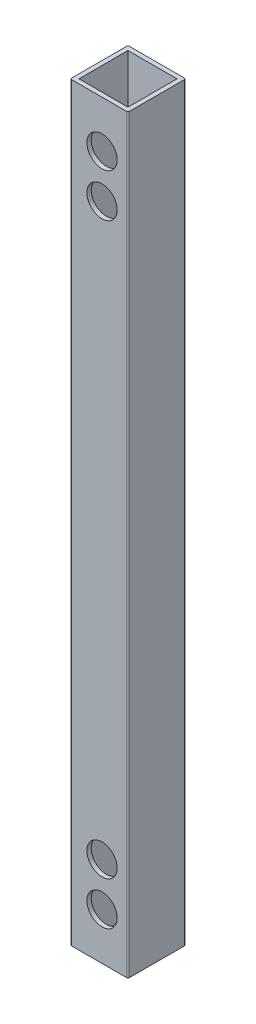
ISO-10303-21;
HEADER;
FILE_DESCRIPTION(('STEP AP214'),'2;1');
FILE_NAME('part.step','',(''),(''),'','','');
FILE_SCHEMA(('AUTOMOTIVE_DESIGN { 1 0 10303 214 1 1 1 1 }'));
ENDSEC;
DATA;
#1=APPLICATION_CONTEXT('core data for automotive mechanical design processes');
#2=APPLICATION_PROTOCOL_DEFINITION('international standard','automotive_design',2000,#1);
#3=PRODUCT_CONTEXT('',#1,'mechanical');
#4=PRODUCT('Part','Part','',(#3));
#5=PRODUCT_RELATED_PRODUCT_CATEGORY('part','',(#4));
#6=PRODUCT_DEFINITION_FORMATION('','',#4);
#7=PRODUCT_DEFINITION_CONTEXT('part definition',#1,'design');
#8=PRODUCT_DEFINITION('design','',#6,#7);
#9=PRODUCT_DEFINITION_SHAPE('','',#8);
#10=(LENGTH_UNIT() NAMED_UNIT(*) SI_UNIT(.MILLI.,.METRE.));
#11=(NAMED_UNIT(*) PLANE_ANGLE_UNIT() SI_UNIT($,.RADIAN.));
#12=(NAMED_UNIT(*) SI_UNIT($,.STERADIAN.) SOLID_ANGLE_UNIT());
#13=UNCERTAINTY_MEASURE_WITH_UNIT(LENGTH_MEASURE(1.E-05),#10,'distance_accuracy_value','');
#14=(GEOMETRIC_REPRESENTATION_CONTEXT(3) GLOBAL_UNCERTAINTY_ASSIGNED_CONTEXT((#13)) GLOBAL_UNIT_ASSIGNED_CONTEXT((#10,
#11,#12)) REPRESENTATION_CONTEXT('',''));
#15=CARTESIAN_POINT('',(0.,0.,0.));
#16=DIRECTION('',(0.,0.,1.));
#17=DIRECTION('',(1.,0.,0.));
#18=AXIS2_PLACEMENT_3D('',#15,#16,#17);
#19=CARTESIAN_POINT('',(19.5,260.,-0.5));
#20=DIRECTION('',(0.,1.,0.));
#21=DIRECTION('',(0.,0.,1.));
#22=AXIS2_PLACEMENT_3D('',#19,#20,#21);
#23=PLANE('',#22);
#24=CARTESIAN_POINT('',(19.5,260.,-0.5));
#25=DIRECTION('',(0.,1.,0.));
#26=DIRECTION('',(0.,0.,1.));
#27=AXIS2_PLACEMENT_3D('',#24,#25,#26);
#28=CIRCLE('',#27,0.5);
#29=CARTESIAN_POINT('',(19.5,260.,0.));
#30=VERTEX_POINT('',#29);
#31=CARTESIAN_POINT('',(20.,260.,-0.5));
#32=VERTEX_POINT('',#31);
#33=EDGE_CURVE('E162',#30,#32,#28,.T.);
#34=ORIENTED_EDGE('',*,*,#33,.T.);
#35=DIRECTION('',(0.,0.,-1.));
#36=VECTOR('',#35,1.);
#37=CARTESIAN_POINT('',(20.,260.,-0.5));
#38=LINE('',#37,#36);
#39=CARTESIAN_POINT('',(20.,260.,-19.5));
#40=VERTEX_POINT('',#39);
#41=EDGE_CURVE('E165',#32,#40,#38,.T.);
#42=ORIENTED_EDGE('',*,*,#41,.T.);
#43=CARTESIAN_POINT('',(19.5,260.,-19.5));
#44=DIRECTION('',(0.,1.,0.));
#45=DIRECTION('',(0.,0.,-1.));
#46=AXIS2_PLACEMENT_3D('',#43,#44,#45);
#47=CIRCLE('',#46,0.5);
#48=CARTESIAN_POINT('',(19.5,260.,-20.));
#49=VERTEX_POINT('',#48);
#50=EDGE_CURVE('E168',#40,#49,#47,.T.);
#51=ORIENTED_EDGE('',*,*,#50,.T.);
#52=DIRECTION('',(-1.,0.,0.));
#53=VECTOR('',#52,1.);
#54=CARTESIAN_POINT('',(0.5,260.,-20.));
#55=LINE('',#54,#53);
#56=CARTESIAN_POINT('',(0.5,260.,-20.));
#57=VERTEX_POINT('',#56);
#58=EDGE_CURVE('E170',#49,#57,#55,.T.);
#59=ORIENTED_EDGE('',*,*,#58,.T.);
#60=CARTESIAN_POINT('',(0.5,260.,-19.5));
#61=DIRECTION('',(0.,1.,0.));
#62=DIRECTION('',(0.,0.,-1.));
#63=AXIS2_PLACEMENT_3D('',#60,#61,#62);
#64=CIRCLE('',#63,0.5);
#65=CARTESIAN_POINT('',(0.,260.,-19.5));
#66=VERTEX_POINT('',#65);
#67=EDGE_CURVE('E172',#57,#66,#64,.T.);
#68=ORIENTED_EDGE('',*,*,#67,.T.);
#69=DIRECTION('',(0.,0.,1.));
#70=VECTOR('',#69,1.);
#71=CARTESIAN_POINT('',(0.,260.,-0.500000000000004));
#72=LINE('',#71,#70);
#73=CARTESIAN_POINT('',(0.,260.,-0.500000000000003));
#74=VERTEX_POINT('',#73);
#75=EDGE_CURVE('E174',#66,#74,#72,.T.);
#76=ORIENTED_EDGE('',*,*,#75,.T.);
#77=CARTESIAN_POINT('',(0.5,260.,-0.5));
#78=DIRECTION('',(0.,1.,0.));
#79=DIRECTION('',(0.,0.,-1.));
#80=AXIS2_PLACEMENT_3D('',#77,#78,#79);
#81=CIRCLE('',#80,0.5);
#82=CARTESIAN_POINT('',(0.500000000000004,260.,0.));
#83=VERTEX_POINT('',#82);
#84=EDGE_CURVE('E176',#74,#83,#81,.T.);
#85=ORIENTED_EDGE('',*,*,#84,.T.);
#86=DIRECTION('',(1.,0.,0.));
#87=VECTOR('',#86,1.);
#88=CARTESIAN_POINT('',(0.500000000000004,260.,0.));
#89=LINE('',#88,#87);
#90=EDGE_CURVE('E178',#83,#30,#89,.T.);
#91=ORIENTED_EDGE('',*,*,#90,.T.);
#92=EDGE_LOOP('',(#34,#42,#51,#59,#68,#76,#85,#91));
#93=FACE_BOUND('',#92,.T.);
#94=DIRECTION('',(1.,0.,0.));
#95=VECTOR('',#94,1.);
#96=CARTESIAN_POINT('',(1.5,260.,-1.5));
#97=LINE('',#96,#95);
#98=CARTESIAN_POINT('',(1.5,260.,-1.5));
#99=VERTEX_POINT('',#98);
#100=CARTESIAN_POINT('',(18.5,260.,-1.5));
#101=VERTEX_POINT('',#100);
#102=EDGE_CURVE('E132',#99,#101,#97,.T.);
#103=ORIENTED_EDGE('',*,*,#102,.F.);
#104=DIRECTION('',(0.,0.,1.));
#105=VECTOR('',#104,1.);
#106=CARTESIAN_POINT('',(1.5,260.,-1.5));
#107=LINE('',#106,#105);
#108=CARTESIAN_POINT('',(1.5,260.,-18.5));
#109=VERTEX_POINT('',#108);
#110=EDGE_CURVE('E124',#109,#99,#107,.T.);
#111=ORIENTED_EDGE('',*,*,#110,.F.);
#112=DIRECTION('',(-1.,0.,0.));
#113=VECTOR('',#112,1.);
#114=CARTESIAN_POINT('',(1.5,260.,-18.5));
#115=LINE('',#114,#113);
#116=CARTESIAN_POINT('',(18.5,260.,-18.5));
#117=VERTEX_POINT('',#116);
#118=EDGE_CURVE('E146',#117,#109,#115,.T.);
#119=ORIENTED_EDGE('',*,*,#118,.F.);
#120=DIRECTION('',(0.,0.,-1.));
#121=VECTOR('',#120,1.);
#122=CARTESIAN_POINT('',(18.5,260.,-1.5));
#123=LINE('',#122,#121);
#124=EDGE_CURVE('E144',#101,#117,#123,.T.);
#125=ORIENTED_EDGE('',*,*,#124,.F.);
#126=EDGE_LOOP('',(#103,#111,#119,#125));
#127=FACE_BOUND('',#126,.T.);
#128=ADVANCED_FACE('F33',(#93,#127),#23,.T.);
#129=CARTESIAN_POINT('',(19.5,0.,-0.5));
#130=DIRECTION('',(0.,1.,0.));
#131=DIRECTION('',(0.,0.,1.));
#132=AXIS2_PLACEMENT_3D('',#129,#130,#131);
#133=PLANE('',#132);
#134=CARTESIAN_POINT('',(19.5,0.,-0.5));
#135=DIRECTION('',(0.,1.,0.));
#136=DIRECTION('',(0.,0.,1.));
#137=AXIS2_PLACEMENT_3D('',#134,#135,#136);
#138=CIRCLE('',#137,0.5);
#139=CARTESIAN_POINT('',(19.5,0.,0.));
#140=VERTEX_POINT('',#139);
#141=CARTESIAN_POINT('',(20.,0.,-0.5));
#142=VERTEX_POINT('',#141);
#143=EDGE_CURVE('E140',#140,#142,#138,.T.);
#144=ORIENTED_EDGE('',*,*,#143,.F.);
#145=DIRECTION('',(1.,0.,0.));
#146=VECTOR('',#145,1.);
#147=CARTESIAN_POINT('',(0.500000000000004,0.,0.));
#148=LINE('',#147,#146);
#149=CARTESIAN_POINT('',(0.500000000000004,0.,0.));
#150=VERTEX_POINT('',#149);
#151=EDGE_CURVE('E166',#150,#140,#148,.T.);
#152=ORIENTED_EDGE('',*,*,#151,.F.);
#153=CARTESIAN_POINT('',(0.5,0.,-0.5));
#154=DIRECTION('',(0.,1.,0.));
#155=DIRECTION('',(0.,0.,-1.));
#156=AXIS2_PLACEMENT_3D('',#153,#154,#155);
#157=CIRCLE('',#156,0.5);
#158=CARTESIAN_POINT('',(0.,0.,-0.500000000000003));
#159=VERTEX_POINT('',#158);
#160=EDGE_CURVE('E193',#159,#150,#157,.T.);
#161=ORIENTED_EDGE('',*,*,#160,.F.);
#162=DIRECTION('',(0.,0.,1.));
#163=VECTOR('',#162,1.);
#164=CARTESIAN_POINT('',(0.,0.,-0.500000000000004));
#165=LINE('',#164,#163);
#166=CARTESIAN_POINT('',(0.,0.,-19.5));
#167=VERTEX_POINT('',#166);
#168=EDGE_CURVE('E191',#167,#159,#165,.T.);
#169=ORIENTED_EDGE('',*,*,#168,.F.);
#170=CARTESIAN_POINT('',(0.5,0.,-19.5));
#171=DIRECTION('',(0.,1.,0.));
#172=DIRECTION('',(0.,0.,-1.));
#173=AXIS2_PLACEMENT_3D('',#170,#171,#172);
#174=CIRCLE('',#173,0.5);
#175=CARTESIAN_POINT('',(0.5,0.,-20.));
#176=VERTEX_POINT('',#175);
#177=EDGE_CURVE('E189',#176,#167,#174,.T.);
#178=ORIENTED_EDGE('',*,*,#177,.F.);
#179=DIRECTION('',(-1.,0.,0.));
#180=VECTOR('',#179,1.);
#181=CARTESIAN_POINT('',(0.5,0.,-20.));
#182=LINE('',#181,#180);
#183=CARTESIAN_POINT('',(19.5,0.,-20.));
#184=VERTEX_POINT('',#183);
#185=EDGE_CURVE('E187',#184,#176,#182,.T.);
#186=ORIENTED_EDGE('',*,*,#185,.F.);
#187=CARTESIAN_POINT('',(19.5,0.,-19.5));
#188=DIRECTION('',(0.,1.,0.));
#189=DIRECTION('',(0.,0.,-1.));
#190=AXIS2_PLACEMENT_3D('',#187,#188,#189);
#191=CIRCLE('',#190,0.5);
#192=CARTESIAN_POINT('',(20.,0.,-19.5));
#193=VERTEX_POINT('',#192);
#194=EDGE_CURVE('E185',#193,#184,#191,.T.);
#195=ORIENTED_EDGE('',*,*,#194,.F.);
#196=DIRECTION('',(0.,0.,-1.));
#197=VECTOR('',#196,1.);
#198=CARTESIAN_POINT('',(20.,0.,-0.5));
#199=LINE('',#198,#197);
#200=EDGE_CURVE('E183',#142,#193,#199,.T.);
#201=ORIENTED_EDGE('',*,*,#200,.F.);
#202=EDGE_LOOP('',(#144,#152,#161,#169,#178,#186,#195,#201));
#203=FACE_BOUND('',#202,.T.);
#204=DIRECTION('',(0.,0.,1.));
#205=VECTOR('',#204,1.);
#206=CARTESIAN_POINT('',(1.5,0.,-1.5));
#207=LINE('',#206,#205);
#208=CARTESIAN_POINT('',(1.5,0.,-18.5));
#209=VERTEX_POINT('',#208);
#210=CARTESIAN_POINT('',(1.5,0.,-1.5));
#211=VERTEX_POINT('',#210);
#212=EDGE_CURVE('E58',#209,#211,#207,.T.);
#213=ORIENTED_EDGE('',*,*,#212,.T.);
#214=DIRECTION('',(1.,0.,0.));
#215=VECTOR('',#214,1.);
#216=CARTESIAN_POINT('',(1.5,0.,-1.5));
#217=LINE('',#216,#215);
#218=CARTESIAN_POINT('',(18.5,0.,-1.5));
#219=VERTEX_POINT('',#218);
#220=EDGE_CURVE('E139',#211,#219,#217,.T.);
#221=ORIENTED_EDGE('',*,*,#220,.T.);
#222=DIRECTION('',(0.,0.,-1.));
#223=VECTOR('',#222,1.);
#224=CARTESIAN_POINT('',(18.5,0.,-1.5));
#225=LINE('',#224,#223);
#226=CARTESIAN_POINT('',(18.5,0.,-18.5));
#227=VERTEX_POINT('',#226);
#228=EDGE_CURVE('E154',#219,#227,#225,.T.);
#229=ORIENTED_EDGE('',*,*,#228,.T.);
#230=DIRECTION('',(-1.,0.,0.));
#231=VECTOR('',#230,1.);
#232=CARTESIAN_POINT('',(1.5,0.,-18.5));
#233=LINE('',#232,#231);
#234=EDGE_CURVE('E133',#227,#209,#233,.T.);
#235=ORIENTED_EDGE('',*,*,#234,.T.);
#236=EDGE_LOOP('',(#213,#221,#229,#235));
#237=FACE_BOUND('',#236,.T.);
#238=ADVANCED_FACE('F288',(#203,#237),#133,.F.);
#239=CARTESIAN_POINT('',(19.5,260.,-0.5));
#240=DIRECTION('',(0.,-1.,0.));
#241=DIRECTION('',(0.,0.,-1.));
#242=AXIS2_PLACEMENT_3D('',#239,#240,#241);
#243=CYLINDRICAL_SURFACE('',#242,0.5);
#244=ORIENTED_EDGE('',*,*,#143,.T.);
#245=DIRECTION('',(0.,-1.,0.));
#246=VECTOR('',#245,1.);
#247=CARTESIAN_POINT('',(20.,260.,-0.5));
#248=LINE('',#247,#246);
#249=EDGE_CURVE('E11',#32,#142,#248,.T.);
#250=ORIENTED_EDGE('',*,*,#249,.F.);
#251=ORIENTED_EDGE('',*,*,#33,.F.);
#252=DIRECTION('',(0.,-1.,0.));
#253=VECTOR('',#252,1.);
#254=CARTESIAN_POINT('',(19.5,260.,0.));
#255=LINE('',#254,#253);
#256=EDGE_CURVE('E180',#30,#140,#255,.T.);
#257=ORIENTED_EDGE('',*,*,#256,.T.);
#258=EDGE_LOOP('',(#244,#250,#251,#257));
#259=FACE_BOUND('',#258,.T.);
#260=ADVANCED_FACE('F35',(#259),#243,.T.);
#261=CARTESIAN_POINT('',(20.,260.,-0.5));
#262=DIRECTION('',(-1.,0.,0.));
#263=DIRECTION('',(0.,0.,1.));
#264=AXIS2_PLACEMENT_3D('',#261,#262,#263);
#265=PLANE('',#264);
#266=ORIENTED_EDGE('',*,*,#200,.T.);
#267=DIRECTION('',(0.,-1.,0.));
#268=VECTOR('',#267,1.);
#269=CARTESIAN_POINT('',(20.,260.,-19.5));
#270=LINE('',#269,#268);
#271=EDGE_CURVE('E42',#40,#193,#270,.T.);
#272=ORIENTED_EDGE('',*,*,#271,.F.);
#273=ORIENTED_EDGE('',*,*,#41,.F.);
#274=ORIENTED_EDGE('',*,*,#249,.T.);
#275=EDGE_LOOP('',(#266,#272,#273,#274));
#276=FACE_BOUND('',#275,.T.);
#277=ADVANCED_FACE('F294',(#276),#265,.F.);
#278=CARTESIAN_POINT('',(19.5,260.,-19.5));
#279=DIRECTION('',(0.,-1.,0.));
#280=DIRECTION('',(0.,0.,-1.));
#281=AXIS2_PLACEMENT_3D('',#278,#279,#280);
#282=CYLINDRICAL_SURFACE('',#281,0.5);
#283=ORIENTED_EDGE('',*,*,#194,.T.);
#284=DIRECTION('',(0.,-1.,0.));
#285=VECTOR('',#284,1.);
#286=CARTESIAN_POINT('',(19.5,260.,-20.));
#287=LINE('',#286,#285);
#288=EDGE_CURVE('E210',#49,#184,#287,.T.);
#289=ORIENTED_EDGE('',*,*,#288,.F.);
#290=ORIENTED_EDGE('',*,*,#50,.F.);
#291=ORIENTED_EDGE('',*,*,#271,.T.);
#292=EDGE_LOOP('',(#283,#289,#290,#291));
#293=FACE_BOUND('',#292,.T.);
#294=ADVANCED_FACE('F315',(#293),#282,.T.);
#295=CARTESIAN_POINT('',(0.5,260.,-20.));
#296=DIRECTION('',(0.,0.,1.));
#297=DIRECTION('',(1.,0.,0.));
#298=AXIS2_PLACEMENT_3D('',#295,#296,#297);
#299=PLANE('',#298);
#300=CARTESIAN_POINT('',(11.,243.75,-20.));
#301=DIRECTION('',(0.,0.,1.));
#302=DIRECTION('',(1.,0.,0.));
#303=AXIS2_PLACEMENT_3D('',#300,#301,#302);
#304=CIRCLE('',#303,2.65);
#305=CARTESIAN_POINT('',(13.65,243.75,-20.));
#306=VERTEX_POINT('',#305);
#307=EDGE_CURVE('E219',#306,#306,#304,.T.);
#308=ORIENTED_EDGE('',*,*,#307,.T.);
#309=EDGE_LOOP('',(#308));
#310=FACE_BOUND('',#309,.T.);
#311=CARTESIAN_POINT('',(11.,228.75,-20.));
#312=DIRECTION('',(0.,0.,1.));
#313=DIRECTION('',(1.,0.,0.));
#314=AXIS2_PLACEMENT_3D('',#311,#312,#313);
#315=CIRCLE('',#314,2.65);
#316=CARTESIAN_POINT('',(13.65,228.75,-20.));
#317=VERTEX_POINT('',#316);
#318=EDGE_CURVE('E246',#317,#317,#315,.T.);
#319=ORIENTED_EDGE('',*,*,#318,.T.);
#320=EDGE_LOOP('',(#319));
#321=FACE_BOUND('',#320,.T.);
#322=CARTESIAN_POINT('',(11.,31.25,-20.));
#323=DIRECTION('',(0.,0.,1.));
#324=DIRECTION('',(-1.,0.,0.));
#325=AXIS2_PLACEMENT_3D('',#322,#323,#324);
#326=CIRCLE('',#325,2.65);
#327=CARTESIAN_POINT('',(8.35,31.25,-20.));
#328=VERTEX_POINT('',#327);
#329=EDGE_CURVE('E242',#328,#328,#326,.T.);
#330=ORIENTED_EDGE('',*,*,#329,.T.);
#331=EDGE_LOOP('',(#330));
#332=FACE_BOUND('',#331,.T.);
#333=CARTESIAN_POINT('',(11.,16.25,-20.));
#334=DIRECTION('',(0.,0.,1.));
#335=DIRECTION('',(-1.,0.,0.));
#336=AXIS2_PLACEMENT_3D('',#333,#334,#335);
#337=CIRCLE('',#336,2.65);
#338=CARTESIAN_POINT('',(8.35,16.25,-20.));
#339=VERTEX_POINT('',#338);
#340=EDGE_CURVE('E238',#339,#339,#337,.T.);
#341=ORIENTED_EDGE('',*,*,#340,.T.);
#342=EDGE_LOOP('',(#341));
#343=FACE_BOUND('',#342,.T.);
#344=ORIENTED_EDGE('',*,*,#185,.T.);
#345=DIRECTION('',(0.,-1.,0.));
#346=VECTOR('',#345,1.);
#347=CARTESIAN_POINT('',(0.5,260.,-20.));
#348=LINE('',#347,#346);
#349=EDGE_CURVE('E207',#57,#176,#348,.T.);
#350=ORIENTED_EDGE('',*,*,#349,.F.);
#351=ORIENTED_EDGE('',*,*,#58,.F.);
#352=ORIENTED_EDGE('',*,*,#288,.T.);
#353=EDGE_LOOP('',(#344,#350,#351,#352));
#354=FACE_BOUND('',#353,.T.);
#355=ADVANCED_FACE('F312',(#310,#321,#332,#343,#354),#299,.F.);
#356=CARTESIAN_POINT('',(0.5,260.,-19.5));
#357=DIRECTION('',(0.,-1.,0.));
#358=DIRECTION('',(0.,0.,-1.));
#359=AXIS2_PLACEMENT_3D('',#356,#357,#358);
#360=CYLINDRICAL_SURFACE('',#359,0.5);
#361=ORIENTED_EDGE('',*,*,#177,.T.);
#362=DIRECTION('',(0.,-1.,0.));
#363=VECTOR('',#362,1.);
#364=CARTESIAN_POINT('',(0.,260.,-19.5));
#365=LINE('',#364,#363);
#366=EDGE_CURVE('E204',#66,#167,#365,.T.);
#367=ORIENTED_EDGE('',*,*,#366,.F.);
#368=ORIENTED_EDGE('',*,*,#67,.F.);
#369=ORIENTED_EDGE('',*,*,#349,.T.);
#370=EDGE_LOOP('',(#361,#367,#368,#369));
#371=FACE_BOUND('',#370,.T.);
#372=ADVANCED_FACE('F308',(#371),#360,.T.);
#373=CARTESIAN_POINT('',(0.,260.,-0.500000000000004));
#374=DIRECTION('',(1.,0.,0.));
#375=DIRECTION('',(0.,0.,-1.));
#376=AXIS2_PLACEMENT_3D('',#373,#374,#375);
#377=PLANE('',#376);
#378=ORIENTED_EDGE('',*,*,#168,.T.);
#379=DIRECTION('',(0.,-1.,0.));
#380=VECTOR('',#379,1.);
#381=CARTESIAN_POINT('',(0.,260.,-0.500000000000003));
#382=LINE('',#381,#380);
#383=EDGE_CURVE('E201',#74,#159,#382,.T.);
#384=ORIENTED_EDGE('',*,*,#383,.F.);
#385=ORIENTED_EDGE('',*,*,#75,.F.);
#386=ORIENTED_EDGE('',*,*,#366,.T.);
#387=EDGE_LOOP('',(#378,#384,#385,#386));
#388=FACE_BOUND('',#387,.T.);
#389=ADVANCED_FACE('F304',(#388),#377,.F.);
#390=CARTESIAN_POINT('',(0.5,260.,-0.5));
#391=DIRECTION('',(0.,-1.,0.));
#392=DIRECTION('',(0.,0.,-1.));
#393=AXIS2_PLACEMENT_3D('',#390,#391,#392);
#394=CYLINDRICAL_SURFACE('',#393,0.5);
#395=ORIENTED_EDGE('',*,*,#160,.T.);
#396=DIRECTION('',(0.,-1.,0.));
#397=VECTOR('',#396,1.);
#398=CARTESIAN_POINT('',(0.500000000000004,260.,0.));
#399=LINE('',#398,#397);
#400=EDGE_CURVE('E198',#83,#150,#399,.T.);
#401=ORIENTED_EDGE('',*,*,#400,.F.);
#402=ORIENTED_EDGE('',*,*,#84,.F.);
#403=ORIENTED_EDGE('',*,*,#383,.T.);
#404=EDGE_LOOP('',(#395,#401,#402,#403));
#405=FACE_BOUND('',#404,.T.);
#406=ADVANCED_FACE('F270',(#405),#394,.T.);
#407=CARTESIAN_POINT('',(0.500000000000004,260.,0.));
#408=DIRECTION('',(0.,0.,-1.));
#409=DIRECTION('',(-1.,0.,0.));
#410=AXIS2_PLACEMENT_3D('',#407,#408,#409);
#411=PLANE('',#410);
#412=CARTESIAN_POINT('',(11.,243.75,0.));
#413=DIRECTION('',(0.,0.,1.));
#414=DIRECTION('',(1.,0.,0.));
#415=AXIS2_PLACEMENT_3D('',#412,#413,#414);
#416=CIRCLE('',#415,5.25);
#417=CARTESIAN_POINT('',(16.25,243.75,0.));
#418=VERTEX_POINT('',#417);
#419=EDGE_CURVE('E231',#418,#418,#416,.T.);
#420=ORIENTED_EDGE('',*,*,#419,.F.);
#421=EDGE_LOOP('',(#420));
#422=FACE_BOUND('',#421,.T.);
#423=CARTESIAN_POINT('',(11.,228.75,0.));
#424=DIRECTION('',(0.,0.,1.));
#425=DIRECTION('',(1.,0.,0.));
#426=AXIS2_PLACEMENT_3D('',#423,#424,#425);
#427=CIRCLE('',#426,5.25);
#428=CARTESIAN_POINT('',(16.25,228.75,0.));
#429=VERTEX_POINT('',#428);
#430=EDGE_CURVE('E259',#429,#429,#427,.T.);
#431=ORIENTED_EDGE('',*,*,#430,.F.);
#432=EDGE_LOOP('',(#431));
#433=FACE_BOUND('',#432,.T.);
#434=CARTESIAN_POINT('',(11.,31.25,0.));
#435=DIRECTION('',(0.,0.,1.));
#436=DIRECTION('',(1.,0.,0.));
#437=AXIS2_PLACEMENT_3D('',#434,#435,#436);
#438=CIRCLE('',#437,5.25);
#439=CARTESIAN_POINT('',(16.25,31.25,0.));
#440=VERTEX_POINT('',#439);
#441=EDGE_CURVE('E256',#440,#440,#438,.T.);
#442=ORIENTED_EDGE('',*,*,#441,.F.);
#443=EDGE_LOOP('',(#442));
#444=FACE_BOUND('',#443,.T.);
#445=CARTESIAN_POINT('',(11.,16.25,0.));
#446=DIRECTION('',(0.,0.,1.));
#447=DIRECTION('',(1.,0.,0.));
#448=AXIS2_PLACEMENT_3D('',#445,#446,#447);
#449=CIRCLE('',#448,5.25);
#450=CARTESIAN_POINT('',(16.25,16.25,0.));
#451=VERTEX_POINT('',#450);
#452=EDGE_CURVE('E253',#451,#451,#449,.T.);
#453=ORIENTED_EDGE('',*,*,#452,.F.);
#454=EDGE_LOOP('',(#453));
#455=FACE_BOUND('',#454,.T.);
#456=ORIENTED_EDGE('',*,*,#151,.T.);
#457=ORIENTED_EDGE('',*,*,#256,.F.);
#458=ORIENTED_EDGE('',*,*,#90,.F.);
#459=ORIENTED_EDGE('',*,*,#400,.T.);
#460=EDGE_LOOP('',(#456,#457,#458,#459));
#461=FACE_BOUND('',#460,.T.);
#462=ADVANCED_FACE('F267',(#422,#433,#444,#455,#461),#411,.F.);
#463=CARTESIAN_POINT('',(1.5,260.,-1.5));
#464=DIRECTION('',(1.,0.,0.));
#465=DIRECTION('',(0.,0.,-1.));
#466=AXIS2_PLACEMENT_3D('',#463,#464,#465);
#467=PLANE('',#466);
#468=ORIENTED_EDGE('',*,*,#212,.F.);
#469=DIRECTION('',(0.,-1.,0.));
#470=VECTOR('',#469,1.);
#471=CARTESIAN_POINT('',(1.5,260.,-18.5));
#472=LINE('',#471,#470);
#473=EDGE_CURVE('E128',#109,#209,#472,.T.);
#474=ORIENTED_EDGE('',*,*,#473,.F.);
#475=ORIENTED_EDGE('',*,*,#110,.T.);
#476=DIRECTION('',(0.,-1.,0.));
#477=VECTOR('',#476,1.);
#478=CARTESIAN_POINT('',(1.5,260.,-1.5));
#479=LINE('',#478,#477);
#480=EDGE_CURVE('E127',#99,#211,#479,.T.);
#481=ORIENTED_EDGE('',*,*,#480,.T.);
#482=EDGE_LOOP('',(#468,#474,#475,#481));
#483=FACE_BOUND('',#482,.T.);
#484=ADVANCED_FACE('F126',(#483),#467,.T.);
#485=CARTESIAN_POINT('',(1.5,260.,-1.5));
#486=DIRECTION('',(0.,0.,-1.));
#487=DIRECTION('',(-1.,0.,0.));
#488=AXIS2_PLACEMENT_3D('',#485,#486,#487);
#489=PLANE('',#488);
#490=CARTESIAN_POINT('',(11.,243.75,-1.5));
#491=DIRECTION('',(0.,0.,-1.));
#492=DIRECTION('',(-1.,0.,0.));
#493=AXIS2_PLACEMENT_3D('',#490,#491,#492);
#494=CIRCLE('',#493,5.25);
#495=CARTESIAN_POINT('',(5.75,243.75,-1.5));
#496=VERTEX_POINT('',#495);
#497=EDGE_CURVE('E37',#496,#496,#494,.T.);
#498=ORIENTED_EDGE('',*,*,#497,.F.);
#499=EDGE_LOOP('',(#498));
#500=FACE_BOUND('',#499,.T.);
#501=CARTESIAN_POINT('',(11.,228.75,-1.5));
#502=DIRECTION('',(0.,0.,-1.));
#503=DIRECTION('',(-1.,0.,0.));
#504=AXIS2_PLACEMENT_3D('',#501,#502,#503);
#505=CIRCLE('',#504,5.25);
#506=CARTESIAN_POINT('',(5.75,228.75,-1.5));
#507=VERTEX_POINT('',#506);
#508=EDGE_CURVE('E233',#507,#507,#505,.T.);
#509=ORIENTED_EDGE('',*,*,#508,.F.);
#510=EDGE_LOOP('',(#509));
#511=FACE_BOUND('',#510,.T.);
#512=CARTESIAN_POINT('',(11.,31.25,-1.5));
#513=DIRECTION('',(0.,0.,-1.));
#514=DIRECTION('',(-1.,0.,0.));
#515=AXIS2_PLACEMENT_3D('',#512,#513,#514);
#516=CIRCLE('',#515,5.25);
#517=CARTESIAN_POINT('',(5.75,31.25,-1.5));
#518=VERTEX_POINT('',#517);
#519=EDGE_CURVE('E230',#518,#518,#516,.T.);
#520=ORIENTED_EDGE('',*,*,#519,.F.);
#521=EDGE_LOOP('',(#520));
#522=FACE_BOUND('',#521,.T.);
#523=CARTESIAN_POINT('',(11.,16.25,-1.5));
#524=DIRECTION('',(0.,0.,-1.));
#525=DIRECTION('',(-1.,0.,0.));
#526=AXIS2_PLACEMENT_3D('',#523,#524,#525);
#527=CIRCLE('',#526,5.25);
#528=CARTESIAN_POINT('',(5.75,16.25,-1.5));
#529=VERTEX_POINT('',#528);
#530=EDGE_CURVE('E227',#529,#529,#527,.T.);
#531=ORIENTED_EDGE('',*,*,#530,.F.);
#532=EDGE_LOOP('',(#531));
#533=FACE_BOUND('',#532,.T.);
#534=ORIENTED_EDGE('',*,*,#220,.F.);
#535=ORIENTED_EDGE('',*,*,#480,.F.);
#536=ORIENTED_EDGE('',*,*,#102,.T.);
#537=DIRECTION('',(0.,-1.,0.));
#538=VECTOR('',#537,1.);
#539=CARTESIAN_POINT('',(18.5,260.,-1.5));
#540=LINE('',#539,#538);
#541=EDGE_CURVE('E141',#101,#219,#540,.T.);
#542=ORIENTED_EDGE('',*,*,#541,.T.);
#543=EDGE_LOOP('',(#534,#535,#536,#542));
#544=FACE_BOUND('',#543,.T.);
#545=ADVANCED_FACE('F136',(#500,#511,#522,#533,#544),#489,.T.);
#546=CARTESIAN_POINT('',(18.5,260.,-1.5));
#547=DIRECTION('',(-1.,0.,0.));
#548=DIRECTION('',(0.,0.,1.));
#549=AXIS2_PLACEMENT_3D('',#546,#547,#548);
#550=PLANE('',#549);
#551=ORIENTED_EDGE('',*,*,#228,.F.);
#552=ORIENTED_EDGE('',*,*,#541,.F.);
#553=ORIENTED_EDGE('',*,*,#124,.T.);
#554=DIRECTION('',(0.,-1.,0.));
#555=VECTOR('',#554,1.);
#556=CARTESIAN_POINT('',(18.5,260.,-18.5));
#557=LINE('',#556,#555);
#558=EDGE_CURVE('E50',#117,#227,#557,.T.);
#559=ORIENTED_EDGE('',*,*,#558,.T.);
#560=EDGE_LOOP('',(#551,#552,#553,#559));
#561=FACE_BOUND('',#560,.T.);
#562=ADVANCED_FACE('F367',(#561),#550,.T.);
#563=CARTESIAN_POINT('',(1.5,260.,-18.5));
#564=DIRECTION('',(0.,0.,1.));
#565=DIRECTION('',(1.,0.,0.));
#566=AXIS2_PLACEMENT_3D('',#563,#564,#565);
#567=PLANE('',#566);
#568=CARTESIAN_POINT('',(11.,243.75,-18.5));
#569=DIRECTION('',(0.,0.,1.));
#570=DIRECTION('',(1.,0.,0.));
#571=AXIS2_PLACEMENT_3D('',#568,#569,#570);
#572=CIRCLE('',#571,2.65);
#573=CARTESIAN_POINT('',(13.65,243.75,-18.5));
#574=VERTEX_POINT('',#573);
#575=EDGE_CURVE('E152',#574,#574,#572,.T.);
#576=ORIENTED_EDGE('',*,*,#575,.F.);
#577=EDGE_LOOP('',(#576));
#578=FACE_BOUND('',#577,.T.);
#579=CARTESIAN_POINT('',(11.,228.75,-18.5));
#580=DIRECTION('',(0.,0.,1.));
#581=DIRECTION('',(1.,0.,0.));
#582=AXIS2_PLACEMENT_3D('',#579,#580,#581);
#583=CIRCLE('',#582,2.65);
#584=CARTESIAN_POINT('',(13.65,228.75,-18.5));
#585=VERTEX_POINT('',#584);
#586=EDGE_CURVE('E222',#585,#585,#583,.T.);
#587=ORIENTED_EDGE('',*,*,#586,.F.);
#588=EDGE_LOOP('',(#587));
#589=FACE_BOUND('',#588,.T.);
#590=CARTESIAN_POINT('',(11.,31.25,-18.5));
#591=DIRECTION('',(0.,0.,1.));
#592=DIRECTION('',(1.,0.,0.));
#593=AXIS2_PLACEMENT_3D('',#590,#591,#592);
#594=CIRCLE('',#593,2.65);
#595=CARTESIAN_POINT('',(13.65,31.25,-18.5));
#596=VERTEX_POINT('',#595);
#597=EDGE_CURVE('E218',#596,#596,#594,.T.);
#598=ORIENTED_EDGE('',*,*,#597,.F.);
#599=EDGE_LOOP('',(#598));
#600=FACE_BOUND('',#599,.T.);
#601=CARTESIAN_POINT('',(11.,16.25,-18.5));
#602=DIRECTION('',(0.,0.,1.));
#603=DIRECTION('',(1.,0.,0.));
#604=AXIS2_PLACEMENT_3D('',#601,#602,#603);
#605=CIRCLE('',#604,2.65);
#606=CARTESIAN_POINT('',(13.65,16.25,-18.5));
#607=VERTEX_POINT('',#606);
#608=EDGE_CURVE('E215',#607,#607,#605,.T.);
#609=ORIENTED_EDGE('',*,*,#608,.F.);
#610=EDGE_LOOP('',(#609));
#611=FACE_BOUND('',#610,.T.);
#612=ORIENTED_EDGE('',*,*,#234,.F.);
#613=ORIENTED_EDGE('',*,*,#558,.F.);
#614=ORIENTED_EDGE('',*,*,#118,.T.);
#615=ORIENTED_EDGE('',*,*,#473,.T.);
#616=EDGE_LOOP('',(#612,#613,#614,#615));
#617=FACE_BOUND('',#616,.T.);
#618=ADVANCED_FACE('F374',(#578,#589,#600,#611,#617),#567,.T.);
#619=CARTESIAN_POINT('',(11.,16.25,-20.));
#620=DIRECTION('',(0.,0.,1.));
#621=DIRECTION('',(1.,0.,0.));
#622=AXIS2_PLACEMENT_3D('',#619,#620,#621);
#623=CYLINDRICAL_SURFACE('',#622,2.65);
#624=ORIENTED_EDGE('',*,*,#608,.T.);
#625=EDGE_LOOP('',(#624));
#626=FACE_BOUND('',#625,.T.);
#627=ORIENTED_EDGE('',*,*,#340,.F.);
#628=EDGE_LOOP('',(#627));
#629=FACE_BOUND('',#628,.T.);
#630=ADVANCED_FACE('F382',(#626,#629),#623,.F.);
#631=CARTESIAN_POINT('',(11.,31.25,-20.));
#632=DIRECTION('',(0.,0.,1.));
#633=DIRECTION('',(1.,0.,0.));
#634=AXIS2_PLACEMENT_3D('',#631,#632,#633);
#635=CYLINDRICAL_SURFACE('',#634,2.65);
#636=ORIENTED_EDGE('',*,*,#597,.T.);
#637=EDGE_LOOP('',(#636));
#638=FACE_BOUND('',#637,.T.);
#639=ORIENTED_EDGE('',*,*,#329,.F.);
#640=EDGE_LOOP('',(#639));
#641=FACE_BOUND('',#640,.T.);
#642=ADVANCED_FACE('F390',(#638,#641),#635,.F.);
#643=CARTESIAN_POINT('',(11.,228.75,-20.));
#644=DIRECTION('',(0.,0.,1.));
#645=DIRECTION('',(1.,0.,0.));
#646=AXIS2_PLACEMENT_3D('',#643,#644,#645);
#647=CYLINDRICAL_SURFACE('',#646,2.65);
#648=ORIENTED_EDGE('',*,*,#586,.T.);
#649=EDGE_LOOP('',(#648));
#650=FACE_BOUND('',#649,.T.);
#651=ORIENTED_EDGE('',*,*,#318,.F.);
#652=EDGE_LOOP('',(#651));
#653=FACE_BOUND('',#652,.T.);
#654=ADVANCED_FACE('F398',(#650,#653),#647,.F.);
#655=CARTESIAN_POINT('',(11.,243.75,-20.));
#656=DIRECTION('',(0.,0.,1.));
#657=DIRECTION('',(1.,0.,0.));
#658=AXIS2_PLACEMENT_3D('',#655,#656,#657);
#659=CYLINDRICAL_SURFACE('',#658,2.65);
#660=ORIENTED_EDGE('',*,*,#575,.T.);
#661=EDGE_LOOP('',(#660));
#662=FACE_BOUND('',#661,.T.);
#663=ORIENTED_EDGE('',*,*,#307,.F.);
#664=EDGE_LOOP('',(#663));
#665=FACE_BOUND('',#664,.T.);
#666=ADVANCED_FACE('F406',(#662,#665),#659,.F.);
#667=CARTESIAN_POINT('',(11.,16.25,-10.));
#668=DIRECTION('',(0.,0.,1.));
#669=DIRECTION('',(1.,0.,0.));
#670=AXIS2_PLACEMENT_3D('',#667,#668,#669);
#671=CYLINDRICAL_SURFACE('',#670,5.25);
#672=ORIENTED_EDGE('',*,*,#530,.T.);
#673=EDGE_LOOP('',(#672));
#674=FACE_BOUND('',#673,.T.);
#675=ORIENTED_EDGE('',*,*,#452,.T.);
#676=EDGE_LOOP('',(#675));
#677=FACE_BOUND('',#676,.T.);
#678=ADVANCED_FACE('F413',(#674,#677),#671,.F.);
#679=CARTESIAN_POINT('',(11.,31.25,-10.));
#680=DIRECTION('',(0.,0.,1.));
#681=DIRECTION('',(1.,0.,0.));
#682=AXIS2_PLACEMENT_3D('',#679,#680,#681);
#683=CYLINDRICAL_SURFACE('',#682,5.25);
#684=ORIENTED_EDGE('',*,*,#519,.T.);
#685=EDGE_LOOP('',(#684));
#686=FACE_BOUND('',#685,.T.);
#687=ORIENTED_EDGE('',*,*,#441,.T.);
#688=EDGE_LOOP('',(#687));
#689=FACE_BOUND('',#688,.T.);
#690=ADVANCED_FACE('F420',(#686,#689),#683,.F.);
#691=CARTESIAN_POINT('',(11.,228.75,-10.));
#692=DIRECTION('',(0.,0.,1.));
#693=DIRECTION('',(1.,0.,0.));
#694=AXIS2_PLACEMENT_3D('',#691,#692,#693);
#695=CYLINDRICAL_SURFACE('',#694,5.25);
#696=ORIENTED_EDGE('',*,*,#508,.T.);
#697=EDGE_LOOP('',(#696));
#698=FACE_BOUND('',#697,.T.);
#699=ORIENTED_EDGE('',*,*,#430,.T.);
#700=EDGE_LOOP('',(#699));
#701=FACE_BOUND('',#700,.T.);
#702=ADVANCED_FACE('F428',(#698,#701),#695,.F.);
#703=CARTESIAN_POINT('',(11.,243.75,-10.));
#704=DIRECTION('',(0.,0.,1.));
#705=DIRECTION('',(1.,0.,0.));
#706=AXIS2_PLACEMENT_3D('',#703,#704,#705);
#707=CYLINDRICAL_SURFACE('',#706,5.25);
#708=ORIENTED_EDGE('',*,*,#497,.T.);
#709=EDGE_LOOP('',(#708));
#710=FACE_BOUND('',#709,.T.);
#711=ORIENTED_EDGE('',*,*,#419,.T.);
#712=EDGE_LOOP('',(#711));
#713=FACE_BOUND('',#712,.T.);
#714=ADVANCED_FACE('F265',(#710,#713),#707,.F.);
#715=CLOSED_SHELL('',(#128,#238,#260,#277,#294,#355,#372,#389,#406,#462,#484,#545,#562,#618,
#630,#642,#654,#666,#678,#690,#702,#714));
#716=MANIFOLD_SOLID_BREP('B2',#715);
#717=ADVANCED_BREP_SHAPE_REPRESENTATION('',(#18,#716),#14);
#718=SHAPE_DEFINITION_REPRESENTATION(#9,#717);
ENDSEC;
END-ISO-10303-21;
